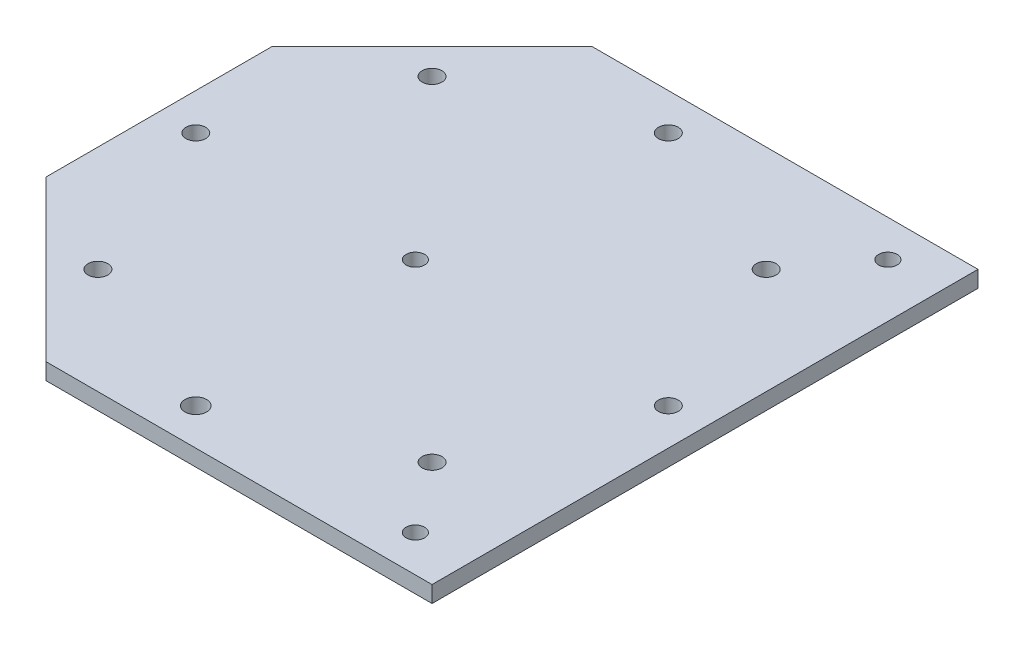
ISO-10303-21;
HEADER;
FILE_DESCRIPTION(('STEP AP214'),'2;1');
FILE_NAME('part.step','',(''),(''),'','','');
FILE_SCHEMA(('AUTOMOTIVE_DESIGN { 1 0 10303 214 1 1 1 1 }'));
ENDSEC;
DATA;
#1=APPLICATION_CONTEXT('core data for automotive mechanical design processes');
#2=APPLICATION_PROTOCOL_DEFINITION('international standard','automotive_design',2000,#1);
#3=PRODUCT_CONTEXT('',#1,'mechanical');
#4=PRODUCT('Part','Part','',(#3));
#5=PRODUCT_RELATED_PRODUCT_CATEGORY('part','',(#4));
#6=PRODUCT_DEFINITION_FORMATION('','',#4);
#7=PRODUCT_DEFINITION_CONTEXT('part definition',#1,'design');
#8=PRODUCT_DEFINITION('design','',#6,#7);
#9=PRODUCT_DEFINITION_SHAPE('','',#8);
#10=(LENGTH_UNIT() NAMED_UNIT(*) SI_UNIT(.MILLI.,.METRE.));
#11=(NAMED_UNIT(*) PLANE_ANGLE_UNIT() SI_UNIT($,.RADIAN.));
#12=(NAMED_UNIT(*) SI_UNIT($,.STERADIAN.) SOLID_ANGLE_UNIT());
#13=UNCERTAINTY_MEASURE_WITH_UNIT(LENGTH_MEASURE(1.E-05),#10,'distance_accuracy_value','');
#14=(GEOMETRIC_REPRESENTATION_CONTEXT(3) GLOBAL_UNCERTAINTY_ASSIGNED_CONTEXT((#13)) GLOBAL_UNIT_ASSIGNED_CONTEXT((#10,
#11,#12)) REPRESENTATION_CONTEXT('',''));
#15=CARTESIAN_POINT('',(0.,0.,0.));
#16=DIRECTION('',(0.,0.,1.));
#17=DIRECTION('',(1.,0.,0.));
#18=AXIS2_PLACEMENT_3D('',#15,#16,#17);
#19=CARTESIAN_POINT('',(-70.33237599072,6.,70.33237599072));
#20=DIRECTION('',(-0.707106781186548,0.,0.707106781186547));
#21=DIRECTION('',(0.707106781186547,0.,0.707106781186548));
#22=AXIS2_PLACEMENT_3D('',#19,#20,#21);
#23=PLANE('',#22);
#24=DIRECTION('',(-0.707106781186547,0.,-0.707106781186548));
#25=VECTOR('',#24,1.);
#26=CARTESIAN_POINT('',(-70.33237599072,0.,70.33237599072));
#27=LINE('',#26,#25);
#28=CARTESIAN_POINT('',(-41.1995242934893,0.,99.4652276879507));
#29=VERTEX_POINT('',#28);
#30=CARTESIAN_POINT('',(-99.4652276879507,0.,41.1995242934892));
#31=VERTEX_POINT('',#30);
#32=EDGE_CURVE('E154',#29,#31,#27,.T.);
#33=ORIENTED_EDGE('',*,*,#32,.F.);
#34=DIRECTION('',(0.,-1.,0.));
#35=VECTOR('',#34,1.);
#36=CARTESIAN_POINT('',(-41.1995242934893,6.,99.4652276879507));
#37=LINE('',#36,#35);
#38=CARTESIAN_POINT('',(-41.1995242934893,6.,99.4652276879507));
#39=VERTEX_POINT('',#38);
#40=EDGE_CURVE('E11',#39,#29,#37,.T.);
#41=ORIENTED_EDGE('',*,*,#40,.F.);
#42=DIRECTION('',(-0.707106781186547,0.,-0.707106781186548));
#43=VECTOR('',#42,1.);
#44=CARTESIAN_POINT('',(-70.33237599072,6.,70.33237599072));
#45=LINE('',#44,#43);
#46=CARTESIAN_POINT('',(-99.4652276879507,6.,41.1995242934892));
#47=VERTEX_POINT('',#46);
#48=EDGE_CURVE('E385',#39,#47,#45,.T.);
#49=ORIENTED_EDGE('',*,*,#48,.T.);
#50=DIRECTION('',(0.,-1.,0.));
#51=VECTOR('',#50,1.);
#52=CARTESIAN_POINT('',(-99.4652276879507,6.,41.1995242934892));
#53=LINE('',#52,#51);
#54=EDGE_CURVE('E81',#47,#31,#53,.T.);
#55=ORIENTED_EDGE('',*,*,#54,.T.);
#56=EDGE_LOOP('',(#33,#41,#49,#55));
#57=FACE_BOUND('',#56,.T.);
#58=ADVANCED_FACE('F35',(#57),#23,.T.);
#59=CARTESIAN_POINT('',(0.,6.,99.4652276879506));
#60=DIRECTION('',(0.,0.,-1.));
#61=DIRECTION('',(-1.,0.,0.));
#62=AXIS2_PLACEMENT_3D('',#59,#60,#61);
#63=PLANE('',#62);
#64=DIRECTION('',(1.,0.,0.));
#65=VECTOR('',#64,1.);
#66=CARTESIAN_POINT('',(0.,0.,99.4652276879506));
#67=LINE('',#66,#65);
#68=CARTESIAN_POINT('',(99.4652506094621,0.,99.4652276879506));
#69=VERTEX_POINT('',#68);
#70=EDGE_CURVE('E156',#29,#69,#67,.T.);
#71=ORIENTED_EDGE('',*,*,#70,.T.);
#72=DIRECTION('',(0.,-1.,0.));
#73=VECTOR('',#72,1.);
#74=CARTESIAN_POINT('',(99.4652506094621,6.,99.4652276879506));
#75=LINE('',#74,#73);
#76=CARTESIAN_POINT('',(99.4652506094621,6.,99.4652276879506));
#77=VERTEX_POINT('',#76);
#78=EDGE_CURVE('E44',#77,#69,#75,.T.);
#79=ORIENTED_EDGE('',*,*,#78,.F.);
#80=DIRECTION('',(1.,0.,0.));
#81=VECTOR('',#80,1.);
#82=CARTESIAN_POINT('',(0.,6.,99.4652276879506));
#83=LINE('',#82,#81);
#84=EDGE_CURVE('E116',#39,#77,#83,.T.);
#85=ORIENTED_EDGE('',*,*,#84,.F.);
#86=ORIENTED_EDGE('',*,*,#40,.T.);
#87=EDGE_LOOP('',(#71,#79,#85,#86));
#88=FACE_BOUND('',#87,.T.);
#89=ADVANCED_FACE('F175',(#88),#63,.F.);
#90=CARTESIAN_POINT('',(99.4652506094621,6.,0.));
#91=DIRECTION('',(-1.,0.,0.));
#92=DIRECTION('',(0.,0.,1.));
#93=AXIS2_PLACEMENT_3D('',#90,#91,#92);
#94=PLANE('',#93);
#95=DIRECTION('',(0.,0.,-1.));
#96=VECTOR('',#95,1.);
#97=CARTESIAN_POINT('',(99.4652506094621,0.,0.));
#98=LINE('',#97,#96);
#99=CARTESIAN_POINT('',(99.4652506094621,0.,-99.4652276879507));
#100=VERTEX_POINT('',#99);
#101=EDGE_CURVE('E159',#69,#100,#98,.T.);
#102=ORIENTED_EDGE('',*,*,#101,.T.);
#103=DIRECTION('',(0.,-1.,0.));
#104=VECTOR('',#103,1.);
#105=CARTESIAN_POINT('',(99.4652506094621,6.,-99.4652276879507));
#106=LINE('',#105,#104);
#107=CARTESIAN_POINT('',(99.4652506094621,6.,-99.4652276879507));
#108=VERTEX_POINT('',#107);
#109=EDGE_CURVE('E104',#108,#100,#106,.T.);
#110=ORIENTED_EDGE('',*,*,#109,.F.);
#111=DIRECTION('',(0.,0.,-1.));
#112=VECTOR('',#111,1.);
#113=CARTESIAN_POINT('',(99.4652506094621,6.,0.));
#114=LINE('',#113,#112);
#115=EDGE_CURVE('E113',#77,#108,#114,.T.);
#116=ORIENTED_EDGE('',*,*,#115,.F.);
#117=ORIENTED_EDGE('',*,*,#78,.T.);
#118=EDGE_LOOP('',(#102,#110,#116,#117));
#119=FACE_BOUND('',#118,.T.);
#120=ADVANCED_FACE('F172',(#119),#94,.F.);
#121=CARTESIAN_POINT('',(0.,6.,-99.4652276879507));
#122=DIRECTION('',(0.,0.,-1.));
#123=DIRECTION('',(-1.,0.,0.));
#124=AXIS2_PLACEMENT_3D('',#121,#122,#123);
#125=PLANE('',#124);
#126=DIRECTION('',(1.,0.,0.));
#127=VECTOR('',#126,1.);
#128=CARTESIAN_POINT('',(0.,0.,-99.4652276879507));
#129=LINE('',#128,#127);
#130=CARTESIAN_POINT('',(-41.1995242934893,0.,-99.4652276879507));
#131=VERTEX_POINT('',#130);
#132=EDGE_CURVE('E101',#131,#100,#129,.T.);
#133=ORIENTED_EDGE('',*,*,#132,.F.);
#134=DIRECTION('',(0.,-1.,0.));
#135=VECTOR('',#134,1.);
#136=CARTESIAN_POINT('',(-41.1995242934893,6.,-99.4652276879507));
#137=LINE('',#136,#135);
#138=CARTESIAN_POINT('',(-41.1995242934893,6.,-99.4652276879507));
#139=VERTEX_POINT('',#138);
#140=EDGE_CURVE('E95',#139,#131,#137,.T.);
#141=ORIENTED_EDGE('',*,*,#140,.F.);
#142=DIRECTION('',(1.,0.,0.));
#143=VECTOR('',#142,1.);
#144=CARTESIAN_POINT('',(0.,6.,-99.4652276879507));
#145=LINE('',#144,#143);
#146=EDGE_CURVE('E99',#139,#108,#145,.T.);
#147=ORIENTED_EDGE('',*,*,#146,.T.);
#148=ORIENTED_EDGE('',*,*,#109,.T.);
#149=EDGE_LOOP('',(#133,#141,#147,#148));
#150=FACE_BOUND('',#149,.T.);
#151=ADVANCED_FACE('F97',(#150),#125,.T.);
#152=CARTESIAN_POINT('',(-70.33237599072,6.,-70.33237599072));
#153=DIRECTION('',(0.707106781186548,0.,0.707106781186547));
#154=DIRECTION('',(0.707106781186547,0.,-0.707106781186548));
#155=AXIS2_PLACEMENT_3D('',#152,#153,#154);
#156=PLANE('',#155);
#157=DIRECTION('',(-0.707106781186547,0.,0.707106781186548));
#158=VECTOR('',#157,1.);
#159=CARTESIAN_POINT('',(-70.33237599072,0.,-70.33237599072));
#160=LINE('',#159,#158);
#161=CARTESIAN_POINT('',(-99.4652276879507,0.,-41.1995242934892));
#162=VERTEX_POINT('',#161);
#163=EDGE_CURVE('E163',#131,#162,#160,.T.);
#164=ORIENTED_EDGE('',*,*,#163,.T.);
#165=DIRECTION('',(0.,-1.,0.));
#166=VECTOR('',#165,1.);
#167=CARTESIAN_POINT('',(-99.4652276879507,6.,-41.1995242934892));
#168=LINE('',#167,#166);
#169=CARTESIAN_POINT('',(-99.4652276879507,6.,-41.1995242934892));
#170=VERTEX_POINT('',#169);
#171=EDGE_CURVE('E105',#170,#162,#168,.T.);
#172=ORIENTED_EDGE('',*,*,#171,.F.);
#173=DIRECTION('',(-0.707106781186547,0.,0.707106781186548));
#174=VECTOR('',#173,1.);
#175=CARTESIAN_POINT('',(-70.33237599072,6.,-70.33237599072));
#176=LINE('',#175,#174);
#177=EDGE_CURVE('E108',#139,#170,#176,.T.);
#178=ORIENTED_EDGE('',*,*,#177,.F.);
#179=ORIENTED_EDGE('',*,*,#140,.T.);
#180=EDGE_LOOP('',(#164,#172,#178,#179));
#181=FACE_BOUND('',#180,.T.);
#182=ADVANCED_FACE('F109',(#181),#156,.F.);
#183=CARTESIAN_POINT('',(0.,6.,86.0902506094622));
#184=DIRECTION('',(0.,-1.,0.));
#185=DIRECTION('',(0.,0.,-1.));
#186=AXIS2_PLACEMENT_3D('',#183,#184,#185);
#187=CYLINDRICAL_SURFACE('',#186,3.95112517832027);
#188=CARTESIAN_POINT('',(0.,6.,86.0902506094622));
#189=DIRECTION('',(0.,1.,0.));
#190=DIRECTION('',(0.,0.,1.));
#191=AXIS2_PLACEMENT_3D('',#188,#189,#190);
#192=CIRCLE('',#191,3.95112517832027);
#193=CARTESIAN_POINT('',(0.,6.,90.0413757877824));
#194=VERTEX_POINT('',#193);
#195=EDGE_CURVE('E386',#194,#194,#192,.T.);
#196=ORIENTED_EDGE('',*,*,#195,.T.);
#197=EDGE_LOOP('',(#196));
#198=FACE_BOUND('',#197,.T.);
#199=CARTESIAN_POINT('',(0.,0.,86.0902506094622));
#200=DIRECTION('',(0.,1.,0.));
#201=DIRECTION('',(0.,0.,1.));
#202=AXIS2_PLACEMENT_3D('',#199,#200,#201);
#203=CIRCLE('',#202,3.95112517832027);
#204=CARTESIAN_POINT('',(0.,0.,90.0413757877824));
#205=VERTEX_POINT('',#204);
#206=EDGE_CURVE('E151',#205,#205,#203,.T.);
#207=ORIENTED_EDGE('',*,*,#206,.F.);
#208=EDGE_LOOP('',(#207));
#209=FACE_BOUND('',#208,.T.);
#210=ADVANCED_FACE('F185',(#198,#209),#187,.F.);
#211=CARTESIAN_POINT('',(-86.0902506094622,6.,0.));
#212=DIRECTION('',(0.,-1.,0.));
#213=DIRECTION('',(0.,0.,-1.));
#214=AXIS2_PLACEMENT_3D('',#211,#212,#213);
#215=CYLINDRICAL_SURFACE('',#214,3.60694572217642);
#216=CARTESIAN_POINT('',(-86.0902506094622,6.,0.));
#217=DIRECTION('',(0.,1.,0.));
#218=DIRECTION('',(0.,0.,1.));
#219=AXIS2_PLACEMENT_3D('',#216,#217,#218);
#220=CIRCLE('',#219,3.60694572217642);
#221=CARTESIAN_POINT('',(-86.0902506094622,6.,3.60694572217642));
#222=VERTEX_POINT('',#221);
#223=EDGE_CURVE('E389',#222,#222,#220,.T.);
#224=ORIENTED_EDGE('',*,*,#223,.T.);
#225=EDGE_LOOP('',(#224));
#226=FACE_BOUND('',#225,.T.);
#227=CARTESIAN_POINT('',(-86.0902506094622,0.,0.));
#228=DIRECTION('',(0.,1.,0.));
#229=DIRECTION('',(0.,0.,1.));
#230=AXIS2_PLACEMENT_3D('',#227,#228,#229);
#231=CIRCLE('',#230,3.60694572217642);
#232=CARTESIAN_POINT('',(-86.0902506094622,0.,3.60694572217642));
#233=VERTEX_POINT('',#232);
#234=EDGE_CURVE('E148',#233,#233,#231,.T.);
#235=ORIENTED_EDGE('',*,*,#234,.F.);
#236=EDGE_LOOP('',(#235));
#237=FACE_BOUND('',#236,.T.);
#238=ADVANCED_FACE('F188',(#226,#237),#215,.F.);
#239=CARTESIAN_POINT('',(-60.874999999999,6.,-60.875000000001));
#240=DIRECTION('',(0.,-1.,0.));
#241=DIRECTION('',(0.,0.,-1.));
#242=AXIS2_PLACEMENT_3D('',#239,#240,#241);
#243=CYLINDRICAL_SURFACE('',#242,3.60694572217644);
#244=CARTESIAN_POINT('',(-60.874999999999,6.,-60.875000000001));
#245=DIRECTION('',(0.,1.,0.));
#246=DIRECTION('',(0.,0.,1.));
#247=AXIS2_PLACEMENT_3D('',#244,#245,#246);
#248=CIRCLE('',#247,3.60694572217644);
#249=CARTESIAN_POINT('',(-60.874999999999,6.,-57.2680542778246));
#250=VERTEX_POINT('',#249);
#251=EDGE_CURVE('E394',#250,#250,#248,.T.);
#252=ORIENTED_EDGE('',*,*,#251,.T.);
#253=EDGE_LOOP('',(#252));
#254=FACE_BOUND('',#253,.T.);
#255=CARTESIAN_POINT('',(-60.874999999999,0.,-60.875000000001));
#256=DIRECTION('',(0.,1.,0.));
#257=DIRECTION('',(0.,0.,1.));
#258=AXIS2_PLACEMENT_3D('',#255,#256,#257);
#259=CIRCLE('',#258,3.60694572217644);
#260=CARTESIAN_POINT('',(-60.874999999999,0.,-57.2680542778246));
#261=VERTEX_POINT('',#260);
#262=EDGE_CURVE('E145',#261,#261,#259,.T.);
#263=ORIENTED_EDGE('',*,*,#262,.F.);
#264=EDGE_LOOP('',(#263));
#265=FACE_BOUND('',#264,.T.);
#266=ADVANCED_FACE('F192',(#254,#265),#243,.F.);
#267=CARTESIAN_POINT('',(1.48492329543615E-12,6.,-86.0902506094622));
#268=DIRECTION('',(0.,-1.,0.));
#269=DIRECTION('',(0.,0.,-1.));
#270=AXIS2_PLACEMENT_3D('',#267,#268,#269);
#271=CYLINDRICAL_SURFACE('',#270,3.60694572217643);
#272=CARTESIAN_POINT('',(1.48492329543615E-12,6.,-86.0902506094622));
#273=DIRECTION('',(0.,1.,0.));
#274=DIRECTION('',(0.,0.,1.));
#275=AXIS2_PLACEMENT_3D('',#272,#273,#274);
#276=CIRCLE('',#275,3.60694572217643);
#277=CARTESIAN_POINT('',(1.48492329543615E-12,6.,-82.4833048872857));
#278=VERTEX_POINT('',#277);
#279=EDGE_CURVE('E397',#278,#278,#276,.T.);
#280=ORIENTED_EDGE('',*,*,#279,.T.);
#281=EDGE_LOOP('',(#280));
#282=FACE_BOUND('',#281,.T.);
#283=CARTESIAN_POINT('',(1.48492329543615E-12,0.,-86.0902506094622));
#284=DIRECTION('',(0.,1.,0.));
#285=DIRECTION('',(0.,0.,1.));
#286=AXIS2_PLACEMENT_3D('',#283,#284,#285);
#287=CIRCLE('',#286,3.60694572217643);
#288=CARTESIAN_POINT('',(1.48492329543615E-12,0.,-82.4833048872857));
#289=VERTEX_POINT('',#288);
#290=EDGE_CURVE('E142',#289,#289,#287,.T.);
#291=ORIENTED_EDGE('',*,*,#290,.F.);
#292=EDGE_LOOP('',(#291));
#293=FACE_BOUND('',#292,.T.);
#294=ADVANCED_FACE('F196',(#282,#293),#271,.F.);
#295=CARTESIAN_POINT('',(60.8750000000012,6.,-60.8749999999989));
#296=DIRECTION('',(0.,-1.,0.));
#297=DIRECTION('',(0.,0.,-1.));
#298=AXIS2_PLACEMENT_3D('',#295,#296,#297);
#299=CYLINDRICAL_SURFACE('',#298,3.60694572217642);
#300=CARTESIAN_POINT('',(60.8750000000012,6.,-60.8749999999989));
#301=DIRECTION('',(0.,1.,0.));
#302=DIRECTION('',(0.,0.,1.));
#303=AXIS2_PLACEMENT_3D('',#300,#301,#302);
#304=CIRCLE('',#303,3.60694572217642);
#305=CARTESIAN_POINT('',(60.8750000000012,6.,-57.2680542778225));
#306=VERTEX_POINT('',#305);
#307=EDGE_CURVE('E400',#306,#306,#304,.T.);
#308=ORIENTED_EDGE('',*,*,#307,.T.);
#309=EDGE_LOOP('',(#308));
#310=FACE_BOUND('',#309,.T.);
#311=CARTESIAN_POINT('',(60.8750000000012,0.,-60.8749999999989));
#312=DIRECTION('',(0.,1.,0.));
#313=DIRECTION('',(0.,0.,1.));
#314=AXIS2_PLACEMENT_3D('',#311,#312,#313);
#315=CIRCLE('',#314,3.60694572217642);
#316=CARTESIAN_POINT('',(60.8750000000012,0.,-57.2680542778225));
#317=VERTEX_POINT('',#316);
#318=EDGE_CURVE('E139',#317,#317,#315,.T.);
#319=ORIENTED_EDGE('',*,*,#318,.F.);
#320=EDGE_LOOP('',(#319));
#321=FACE_BOUND('',#320,.T.);
#322=ADVANCED_FACE('F200',(#310,#321),#299,.F.);
#323=CARTESIAN_POINT('',(86.0902506094621,6.,1.79492216005579E-12));
#324=DIRECTION('',(0.,-1.,0.));
#325=DIRECTION('',(0.,0.,-1.));
#326=AXIS2_PLACEMENT_3D('',#323,#324,#325);
#327=CYLINDRICAL_SURFACE('',#326,3.60694572217642);
#328=CARTESIAN_POINT('',(86.0902506094621,6.,1.79492216005579E-12));
#329=DIRECTION('',(0.,1.,0.));
#330=DIRECTION('',(0.,0.,1.));
#331=AXIS2_PLACEMENT_3D('',#328,#329,#330);
#332=CIRCLE('',#331,3.60694572217642);
#333=CARTESIAN_POINT('',(86.0902506094621,6.,3.60694572217821));
#334=VERTEX_POINT('',#333);
#335=EDGE_CURVE('E403',#334,#334,#332,.T.);
#336=ORIENTED_EDGE('',*,*,#335,.T.);
#337=EDGE_LOOP('',(#336));
#338=FACE_BOUND('',#337,.T.);
#339=CARTESIAN_POINT('',(86.0902506094621,0.,1.79492216005579E-12));
#340=DIRECTION('',(0.,1.,0.));
#341=DIRECTION('',(0.,0.,1.));
#342=AXIS2_PLACEMENT_3D('',#339,#340,#341);
#343=CIRCLE('',#342,3.60694572217642);
#344=CARTESIAN_POINT('',(86.0902506094621,0.,3.60694572217821));
#345=VERTEX_POINT('',#344);
#346=EDGE_CURVE('E136',#345,#345,#343,.T.);
#347=ORIENTED_EDGE('',*,*,#346,.F.);
#348=EDGE_LOOP('',(#347));
#349=FACE_BOUND('',#348,.T.);
#350=ADVANCED_FACE('F204',(#338,#349),#327,.F.);
#351=CARTESIAN_POINT('',(60.8749999999986,6.,60.8750000000014));
#352=DIRECTION('',(0.,-1.,0.));
#353=DIRECTION('',(0.,0.,-1.));
#354=AXIS2_PLACEMENT_3D('',#351,#352,#353);
#355=CYLINDRICAL_SURFACE('',#354,3.60694572217641);
#356=CARTESIAN_POINT('',(60.8749999999986,6.,60.8750000000014));
#357=DIRECTION('',(0.,1.,0.));
#358=DIRECTION('',(0.,0.,1.));
#359=AXIS2_PLACEMENT_3D('',#356,#357,#358);
#360=CIRCLE('',#359,3.60694572217641);
#361=CARTESIAN_POINT('',(60.8749999999986,6.,64.4819457221778));
#362=VERTEX_POINT('',#361);
#363=EDGE_CURVE('E406',#362,#362,#360,.T.);
#364=ORIENTED_EDGE('',*,*,#363,.T.);
#365=EDGE_LOOP('',(#364));
#366=FACE_BOUND('',#365,.T.);
#367=CARTESIAN_POINT('',(60.8749999999986,0.,60.8750000000014));
#368=DIRECTION('',(0.,1.,0.));
#369=DIRECTION('',(0.,0.,1.));
#370=AXIS2_PLACEMENT_3D('',#367,#368,#369);
#371=CIRCLE('',#370,3.60694572217641);
#372=CARTESIAN_POINT('',(60.8749999999986,0.,64.4819457221778));
#373=VERTEX_POINT('',#372);
#374=EDGE_CURVE('E133',#373,#373,#371,.T.);
#375=ORIENTED_EDGE('',*,*,#374,.F.);
#376=EDGE_LOOP('',(#375));
#377=FACE_BOUND('',#376,.T.);
#378=ADVANCED_FACE('F208',(#366,#377),#355,.F.);
#379=CARTESIAN_POINT('',(-60.8750000000016,6.,60.8749999999984));
#380=DIRECTION('',(0.,-1.,0.));
#381=DIRECTION('',(0.,0.,-1.));
#382=AXIS2_PLACEMENT_3D('',#379,#380,#381);
#383=CYLINDRICAL_SURFACE('',#382,3.60694572217643);
#384=CARTESIAN_POINT('',(-60.8750000000016,6.,60.8749999999984));
#385=DIRECTION('',(0.,1.,0.));
#386=DIRECTION('',(0.,0.,1.));
#387=AXIS2_PLACEMENT_3D('',#384,#385,#386);
#388=CIRCLE('',#387,3.60694572217643);
#389=CARTESIAN_POINT('',(-60.8750000000016,6.,64.4819457221749));
#390=VERTEX_POINT('',#389);
#391=EDGE_CURVE('E409',#390,#390,#388,.T.);
#392=ORIENTED_EDGE('',*,*,#391,.T.);
#393=EDGE_LOOP('',(#392));
#394=FACE_BOUND('',#393,.T.);
#395=CARTESIAN_POINT('',(-60.8750000000016,0.,60.8749999999984));
#396=DIRECTION('',(0.,1.,0.));
#397=DIRECTION('',(0.,0.,1.));
#398=AXIS2_PLACEMENT_3D('',#395,#396,#397);
#399=CIRCLE('',#398,3.60694572217643);
#400=CARTESIAN_POINT('',(-60.8750000000016,0.,64.4819457221749));
#401=VERTEX_POINT('',#400);
#402=EDGE_CURVE('E130',#401,#401,#399,.T.);
#403=ORIENTED_EDGE('',*,*,#402,.F.);
#404=EDGE_LOOP('',(#403));
#405=FACE_BOUND('',#404,.T.);
#406=ADVANCED_FACE('F212',(#394,#405),#383,.F.);
#407=CARTESIAN_POINT('',(80.0047500609787,6.,86.0902499390213));
#408=DIRECTION('',(0.,-1.,0.));
#409=DIRECTION('',(0.,0.,-1.));
#410=AXIS2_PLACEMENT_3D('',#407,#408,#409);
#411=CYLINDRICAL_SURFACE('',#410,3.37500000187563);
#412=CARTESIAN_POINT('',(80.0047500609787,6.,86.0902499390213));
#413=DIRECTION('',(0.,1.,0.));
#414=DIRECTION('',(0.,0.,1.));
#415=AXIS2_PLACEMENT_3D('',#412,#413,#414);
#416=CIRCLE('',#415,3.37500000187563);
#417=CARTESIAN_POINT('',(80.0047500609787,6.,89.4652499408969));
#418=VERTEX_POINT('',#417);
#419=EDGE_CURVE('E412',#418,#418,#416,.T.);
#420=ORIENTED_EDGE('',*,*,#419,.T.);
#421=EDGE_LOOP('',(#420));
#422=FACE_BOUND('',#421,.T.);
#423=CARTESIAN_POINT('',(80.0047500609787,0.,86.0902499390213));
#424=DIRECTION('',(0.,1.,0.));
#425=DIRECTION('',(0.,0.,1.));
#426=AXIS2_PLACEMENT_3D('',#423,#424,#425);
#427=CIRCLE('',#426,3.37500000187563);
#428=CARTESIAN_POINT('',(80.0047500609787,0.,89.4652499408969));
#429=VERTEX_POINT('',#428);
#430=EDGE_CURVE('E127',#429,#429,#427,.T.);
#431=ORIENTED_EDGE('',*,*,#430,.F.);
#432=EDGE_LOOP('',(#431));
#433=FACE_BOUND('',#432,.T.);
#434=ADVANCED_FACE('F216',(#422,#433),#411,.F.);
#435=CARTESIAN_POINT('',(-6.08550054848303,6.,-6.70440363824496E-07));
#436=DIRECTION('',(0.,-1.,0.));
#437=DIRECTION('',(0.,0.,-1.));
#438=AXIS2_PLACEMENT_3D('',#435,#436,#437);
#439=CYLINDRICAL_SURFACE('',#438,3.37500000129891);
#440=CARTESIAN_POINT('',(-6.08550054848303,6.,-6.70440363824496E-07));
#441=DIRECTION('',(0.,1.,0.));
#442=DIRECTION('',(0.,0.,1.));
#443=AXIS2_PLACEMENT_3D('',#440,#441,#442);
#444=CIRCLE('',#443,3.37500000129891);
#445=CARTESIAN_POINT('',(-6.08550054848303,6.,3.37499933085854));
#446=VERTEX_POINT('',#445);
#447=EDGE_CURVE('E231',#446,#446,#444,.T.);
#448=ORIENTED_EDGE('',*,*,#447,.T.);
#449=EDGE_LOOP('',(#448));
#450=FACE_BOUND('',#449,.T.);
#451=CARTESIAN_POINT('',(-6.08550054848303,0.,-6.70440363824496E-07));
#452=DIRECTION('',(0.,1.,0.));
#453=DIRECTION('',(0.,0.,1.));
#454=AXIS2_PLACEMENT_3D('',#451,#452,#453);
#455=CIRCLE('',#454,3.37500000129891);
#456=CARTESIAN_POINT('',(-6.08550054848303,0.,3.37499933085854));
#457=VERTEX_POINT('',#456);
#458=EDGE_CURVE('E124',#457,#457,#455,.T.);
#459=ORIENTED_EDGE('',*,*,#458,.F.);
#460=EDGE_LOOP('',(#459));
#461=FACE_BOUND('',#460,.T.);
#462=ADVANCED_FACE('F219',(#450,#461),#439,.F.);
#463=CARTESIAN_POINT('',(80.0047500609787,6.,-86.0902512799021));
#464=DIRECTION('',(0.,-1.,0.));
#465=DIRECTION('',(0.,0.,-1.));
#466=AXIS2_PLACEMENT_3D('',#463,#464,#465);
#467=CYLINDRICAL_SURFACE('',#466,3.37499999942943);
#468=CARTESIAN_POINT('',(80.0047500609787,6.,-86.0902512799021));
#469=DIRECTION('',(0.,1.,0.));
#470=DIRECTION('',(0.,0.,1.));
#471=AXIS2_PLACEMENT_3D('',#468,#469,#470);
#472=CIRCLE('',#471,3.37499999942943);
#473=CARTESIAN_POINT('',(80.0047500609787,6.,-82.7152512804727));
#474=VERTEX_POINT('',#473);
#475=EDGE_CURVE('E166',#474,#474,#472,.T.);
#476=ORIENTED_EDGE('',*,*,#475,.T.);
#477=EDGE_LOOP('',(#476));
#478=FACE_BOUND('',#477,.T.);
#479=CARTESIAN_POINT('',(80.0047500609787,0.,-86.0902512799021));
#480=DIRECTION('',(0.,1.,0.));
#481=DIRECTION('',(0.,0.,1.));
#482=AXIS2_PLACEMENT_3D('',#479,#480,#481);
#483=CIRCLE('',#482,3.37499999942943);
#484=CARTESIAN_POINT('',(80.0047500609787,0.,-82.7152512804727));
#485=VERTEX_POINT('',#484);
#486=EDGE_CURVE('E121',#485,#485,#483,.T.);
#487=ORIENTED_EDGE('',*,*,#486,.F.);
#488=EDGE_LOOP('',(#487));
#489=FACE_BOUND('',#488,.T.);
#490=ADVANCED_FACE('F37',(#478,#489),#467,.F.);
#491=CARTESIAN_POINT('',(-99.4652276879507,6.,0.));
#492=DIRECTION('',(1.,0.,0.));
#493=DIRECTION('',(0.,0.,-1.));
#494=AXIS2_PLACEMENT_3D('',#491,#492,#493);
#495=PLANE('',#494);
#496=DIRECTION('',(0.,0.,1.));
#497=VECTOR('',#496,1.);
#498=CARTESIAN_POINT('',(-99.4652276879507,0.,0.));
#499=LINE('',#498,#497);
#500=EDGE_CURVE('E74',#162,#31,#499,.T.);
#501=ORIENTED_EDGE('',*,*,#500,.T.);
#502=ORIENTED_EDGE('',*,*,#54,.F.);
#503=DIRECTION('',(0.,0.,1.));
#504=VECTOR('',#503,1.);
#505=CARTESIAN_POINT('',(-99.4652276879507,6.,0.));
#506=LINE('',#505,#504);
#507=EDGE_CURVE('E52',#170,#47,#506,.T.);
#508=ORIENTED_EDGE('',*,*,#507,.F.);
#509=ORIENTED_EDGE('',*,*,#171,.T.);
#510=EDGE_LOOP('',(#501,#502,#508,#509));
#511=FACE_BOUND('',#510,.T.);
#512=ADVANCED_FACE('F226',(#511),#495,.F.);
#513=CARTESIAN_POINT('',(0.,6.,0.));
#514=DIRECTION('',(0.,1.,0.));
#515=DIRECTION('',(0.,0.,1.));
#516=AXIS2_PLACEMENT_3D('',#513,#514,#515);
#517=PLANE('',#516);
#518=ORIENTED_EDGE('',*,*,#475,.F.);
#519=EDGE_LOOP('',(#518));
#520=FACE_BOUND('',#519,.T.);
#521=ORIENTED_EDGE('',*,*,#447,.F.);
#522=EDGE_LOOP('',(#521));
#523=FACE_BOUND('',#522,.T.);
#524=ORIENTED_EDGE('',*,*,#419,.F.);
#525=EDGE_LOOP('',(#524));
#526=FACE_BOUND('',#525,.T.);
#527=ORIENTED_EDGE('',*,*,#391,.F.);
#528=EDGE_LOOP('',(#527));
#529=FACE_BOUND('',#528,.T.);
#530=ORIENTED_EDGE('',*,*,#363,.F.);
#531=EDGE_LOOP('',(#530));
#532=FACE_BOUND('',#531,.T.);
#533=ORIENTED_EDGE('',*,*,#335,.F.);
#534=EDGE_LOOP('',(#533));
#535=FACE_BOUND('',#534,.T.);
#536=ORIENTED_EDGE('',*,*,#307,.F.);
#537=EDGE_LOOP('',(#536));
#538=FACE_BOUND('',#537,.T.);
#539=ORIENTED_EDGE('',*,*,#279,.F.);
#540=EDGE_LOOP('',(#539));
#541=FACE_BOUND('',#540,.T.);
#542=ORIENTED_EDGE('',*,*,#251,.F.);
#543=EDGE_LOOP('',(#542));
#544=FACE_BOUND('',#543,.T.);
#545=ORIENTED_EDGE('',*,*,#223,.F.);
#546=EDGE_LOOP('',(#545));
#547=FACE_BOUND('',#546,.T.);
#548=ORIENTED_EDGE('',*,*,#195,.F.);
#549=EDGE_LOOP('',(#548));
#550=FACE_BOUND('',#549,.T.);
#551=ORIENTED_EDGE('',*,*,#48,.F.);
#552=ORIENTED_EDGE('',*,*,#84,.T.);
#553=ORIENTED_EDGE('',*,*,#115,.T.);
#554=ORIENTED_EDGE('',*,*,#146,.F.);
#555=ORIENTED_EDGE('',*,*,#177,.T.);
#556=ORIENTED_EDGE('',*,*,#507,.T.);
#557=EDGE_LOOP('',(#551,#552,#553,#554,#555,#556));
#558=FACE_BOUND('',#557,.T.);
#559=ADVANCED_FACE('F111',(#520,#523,#526,#529,#532,#535,#538,#541,#544,#547,#550,#558),#517,.T.);
#560=CARTESIAN_POINT('',(0.,0.,0.));
#561=DIRECTION('',(0.,1.,0.));
#562=DIRECTION('',(0.,0.,1.));
#563=AXIS2_PLACEMENT_3D('',#560,#561,#562);
#564=PLANE('',#563);
#565=ORIENTED_EDGE('',*,*,#486,.T.);
#566=EDGE_LOOP('',(#565));
#567=FACE_BOUND('',#566,.T.);
#568=ORIENTED_EDGE('',*,*,#458,.T.);
#569=EDGE_LOOP('',(#568));
#570=FACE_BOUND('',#569,.T.);
#571=ORIENTED_EDGE('',*,*,#430,.T.);
#572=EDGE_LOOP('',(#571));
#573=FACE_BOUND('',#572,.T.);
#574=ORIENTED_EDGE('',*,*,#402,.T.);
#575=EDGE_LOOP('',(#574));
#576=FACE_BOUND('',#575,.T.);
#577=ORIENTED_EDGE('',*,*,#374,.T.);
#578=EDGE_LOOP('',(#577));
#579=FACE_BOUND('',#578,.T.);
#580=ORIENTED_EDGE('',*,*,#346,.T.);
#581=EDGE_LOOP('',(#580));
#582=FACE_BOUND('',#581,.T.);
#583=ORIENTED_EDGE('',*,*,#318,.T.);
#584=EDGE_LOOP('',(#583));
#585=FACE_BOUND('',#584,.T.);
#586=ORIENTED_EDGE('',*,*,#290,.T.);
#587=EDGE_LOOP('',(#586));
#588=FACE_BOUND('',#587,.T.);
#589=ORIENTED_EDGE('',*,*,#262,.T.);
#590=EDGE_LOOP('',(#589));
#591=FACE_BOUND('',#590,.T.);
#592=ORIENTED_EDGE('',*,*,#234,.T.);
#593=EDGE_LOOP('',(#592));
#594=FACE_BOUND('',#593,.T.);
#595=ORIENTED_EDGE('',*,*,#206,.T.);
#596=EDGE_LOOP('',(#595));
#597=FACE_BOUND('',#596,.T.);
#598=ORIENTED_EDGE('',*,*,#32,.T.);
#599=ORIENTED_EDGE('',*,*,#500,.F.);
#600=ORIENTED_EDGE('',*,*,#163,.F.);
#601=ORIENTED_EDGE('',*,*,#132,.T.);
#602=ORIENTED_EDGE('',*,*,#101,.F.);
#603=ORIENTED_EDGE('',*,*,#70,.F.);
#604=EDGE_LOOP('',(#598,#599,#600,#601,#602,#603));
#605=FACE_BOUND('',#604,.T.);
#606=ADVANCED_FACE('F176',(#567,#570,#573,#576,#579,#582,#585,#588,#591,#594,#597,#605),#564,.F.);
#607=CLOSED_SHELL('',(#58,#89,#120,#151,#182,#210,#238,#266,#294,#322,#350,#378,#406,#434,#462,
#490,#512,#559,#606));
#608=MANIFOLD_SOLID_BREP('B2',#607);
#609=ADVANCED_BREP_SHAPE_REPRESENTATION('',(#18,#608),#14);
#610=SHAPE_DEFINITION_REPRESENTATION(#9,#609);
ENDSEC;
END-ISO-10303-21;
